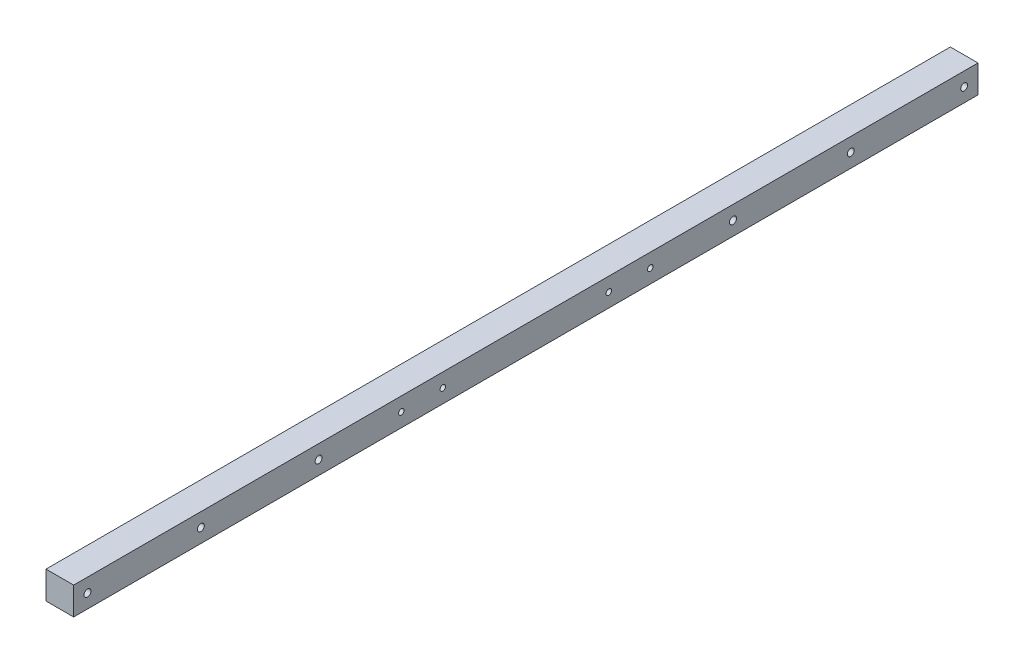
ISO-10303-21;
HEADER;
FILE_DESCRIPTION(('STEP AP214'),'2;1');
FILE_NAME('part.step','',(''),(''),'','','');
FILE_SCHEMA(('AUTOMOTIVE_DESIGN { 1 0 10303 214 1 1 1 1 }'));
ENDSEC;
DATA;
#1=APPLICATION_CONTEXT('core data for automotive mechanical design processes');
#2=APPLICATION_PROTOCOL_DEFINITION('international standard','automotive_design',2000,#1);
#3=PRODUCT_CONTEXT('',#1,'mechanical');
#4=PRODUCT('Part','Part','',(#3));
#5=PRODUCT_RELATED_PRODUCT_CATEGORY('part','',(#4));
#6=PRODUCT_DEFINITION_FORMATION('','',#4);
#7=PRODUCT_DEFINITION_CONTEXT('part definition',#1,'design');
#8=PRODUCT_DEFINITION('design','',#6,#7);
#9=PRODUCT_DEFINITION_SHAPE('','',#8);
#10=(LENGTH_UNIT() NAMED_UNIT(*) SI_UNIT(.MILLI.,.METRE.));
#11=(NAMED_UNIT(*) PLANE_ANGLE_UNIT() SI_UNIT($,.RADIAN.));
#12=(NAMED_UNIT(*) SI_UNIT($,.STERADIAN.) SOLID_ANGLE_UNIT());
#13=UNCERTAINTY_MEASURE_WITH_UNIT(LENGTH_MEASURE(1.E-05),#10,'distance_accuracy_value','');
#14=(GEOMETRIC_REPRESENTATION_CONTEXT(3) GLOBAL_UNCERTAINTY_ASSIGNED_CONTEXT((#13)) GLOBAL_UNIT_ASSIGNED_CONTEXT((#10,
#11,#12)) REPRESENTATION_CONTEXT('',''));
#15=CARTESIAN_POINT('',(0.,0.,0.));
#16=DIRECTION('',(0.,0.,1.));
#17=DIRECTION('',(1.,0.,0.));
#18=AXIS2_PLACEMENT_3D('',#15,#16,#17);
#19=CARTESIAN_POINT('',(12.7,-12.7,830.58));
#20=DIRECTION('',(-1.,0.,0.));
#21=DIRECTION('',(0.,0.,1.));
#22=AXIS2_PLACEMENT_3D('',#19,#20,#21);
#23=PLANE('',#22);
#24=CARTESIAN_POINT('',(12.7,0.,605.58));
#25=DIRECTION('',(-1.,0.,0.));
#26=DIRECTION('',(0.,0.,1.));
#27=AXIS2_PLACEMENT_3D('',#24,#25,#26);
#28=CIRCLE('',#27,3.24999999999995);
#29=CARTESIAN_POINT('',(12.7,0.,608.83));
#30=VERTEX_POINT('',#29);
#31=EDGE_CURVE('E126',#30,#30,#28,.T.);
#32=ORIENTED_EDGE('',*,*,#31,.T.);
#33=EDGE_LOOP('',(#32));
#34=FACE_BOUND('',#33,.T.);
#35=CARTESIAN_POINT('',(12.7,0.,225.));
#36=DIRECTION('',(-1.,0.,0.));
#37=DIRECTION('',(0.,0.,1.));
#38=AXIS2_PLACEMENT_3D('',#35,#36,#37);
#39=CIRCLE('',#38,3.25000000000001);
#40=CARTESIAN_POINT('',(12.7,0.,228.25));
#41=VERTEX_POINT('',#40);
#42=EDGE_CURVE('E242',#41,#41,#39,.T.);
#43=ORIENTED_EDGE('',*,*,#42,.T.);
#44=EDGE_LOOP('',(#43));
#45=FACE_BOUND('',#44,.T.);
#46=CARTESIAN_POINT('',(12.7,0.,300.99));
#47=DIRECTION('',(1.,0.,0.));
#48=DIRECTION('',(0.,0.,-1.));
#49=AXIS2_PLACEMENT_3D('',#46,#47,#48);
#50=CIRCLE('',#49,2.55269999999999);
#51=CARTESIAN_POINT('',(12.7,0.,298.4373));
#52=VERTEX_POINT('',#51);
#53=EDGE_CURVE('E118',#52,#52,#50,.T.);
#54=ORIENTED_EDGE('',*,*,#53,.F.);
#55=EDGE_LOOP('',(#54));
#56=FACE_BOUND('',#55,.T.);
#57=CARTESIAN_POINT('',(12.7,0.,529.59));
#58=DIRECTION('',(1.,0.,0.));
#59=DIRECTION('',(0.,0.,-1.));
#60=AXIS2_PLACEMENT_3D('',#57,#58,#59);
#61=CIRCLE('',#60,2.55269999999999);
#62=CARTESIAN_POINT('',(12.7,0.,527.0373));
#63=VERTEX_POINT('',#62);
#64=EDGE_CURVE('E117',#63,#63,#61,.T.);
#65=ORIENTED_EDGE('',*,*,#64,.F.);
#66=EDGE_LOOP('',(#65));
#67=FACE_BOUND('',#66,.T.);
#68=CARTESIAN_POINT('',(12.7,0.,491.49));
#69=DIRECTION('',(1.,0.,0.));
#70=DIRECTION('',(0.,0.,-1.));
#71=AXIS2_PLACEMENT_3D('',#68,#69,#70);
#72=CIRCLE('',#71,2.55269999999999);
#73=CARTESIAN_POINT('',(12.7,0.,488.9373));
#74=VERTEX_POINT('',#73);
#75=EDGE_CURVE('E133',#74,#74,#72,.T.);
#76=ORIENTED_EDGE('',*,*,#75,.F.);
#77=EDGE_LOOP('',(#76));
#78=FACE_BOUND('',#77,.T.);
#79=CARTESIAN_POINT('',(12.7,0.,339.09));
#80=DIRECTION('',(1.,0.,0.));
#81=DIRECTION('',(0.,0.,-1.));
#82=AXIS2_PLACEMENT_3D('',#79,#80,#81);
#83=CIRCLE('',#82,2.55269999999999);
#84=CARTESIAN_POINT('',(12.7,0.,336.5373));
#85=VERTEX_POINT('',#84);
#86=EDGE_CURVE('E141',#85,#85,#83,.T.);
#87=ORIENTED_EDGE('',*,*,#86,.F.);
#88=EDGE_LOOP('',(#87));
#89=FACE_BOUND('',#88,.T.);
#90=CARTESIAN_POINT('',(12.7,0.,817.88));
#91=DIRECTION('',(-1.,0.,0.));
#92=DIRECTION('',(0.,0.,1.));
#93=AXIS2_PLACEMENT_3D('',#90,#91,#92);
#94=CIRCLE('',#93,3.175);
#95=CARTESIAN_POINT('',(12.7,0.,821.055));
#96=VERTEX_POINT('',#95);
#97=EDGE_CURVE('E150',#96,#96,#94,.T.);
#98=ORIENTED_EDGE('',*,*,#97,.T.);
#99=EDGE_LOOP('',(#98));
#100=FACE_BOUND('',#99,.T.);
#101=CARTESIAN_POINT('',(12.7,0.,713.74));
#102=DIRECTION('',(-1.,0.,0.));
#103=DIRECTION('',(0.,0.,1.));
#104=AXIS2_PLACEMENT_3D('',#101,#102,#103);
#105=CIRCLE('',#104,3.175);
#106=CARTESIAN_POINT('',(12.7,0.,716.915));
#107=VERTEX_POINT('',#106);
#108=EDGE_CURVE('E159',#107,#107,#105,.T.);
#109=ORIENTED_EDGE('',*,*,#108,.T.);
#110=EDGE_LOOP('',(#109));
#111=FACE_BOUND('',#110,.T.);
#112=CARTESIAN_POINT('',(12.7,0.,12.7));
#113=DIRECTION('',(1.,0.,0.));
#114=DIRECTION('',(0.,0.,-1.));
#115=AXIS2_PLACEMENT_3D('',#112,#113,#114);
#116=CIRCLE('',#115,3.175);
#117=CARTESIAN_POINT('',(12.7,0.,9.525));
#118=VERTEX_POINT('',#117);
#119=EDGE_CURVE('E166',#118,#118,#116,.T.);
#120=ORIENTED_EDGE('',*,*,#119,.F.);
#121=EDGE_LOOP('',(#120));
#122=FACE_BOUND('',#121,.T.);
#123=CARTESIAN_POINT('',(12.7,0.,116.84));
#124=DIRECTION('',(1.,0.,0.));
#125=DIRECTION('',(0.,0.,-1.));
#126=AXIS2_PLACEMENT_3D('',#123,#124,#125);
#127=CIRCLE('',#126,3.175);
#128=CARTESIAN_POINT('',(12.7,0.,113.665));
#129=VERTEX_POINT('',#128);
#130=EDGE_CURVE('E175',#129,#129,#127,.T.);
#131=ORIENTED_EDGE('',*,*,#130,.F.);
#132=EDGE_LOOP('',(#131));
#133=FACE_BOUND('',#132,.T.);
#134=DIRECTION('',(0.,1.,0.));
#135=VECTOR('',#134,1.);
#136=CARTESIAN_POINT('',(12.7,-12.7,0.));
#137=LINE('',#136,#135);
#138=CARTESIAN_POINT('',(12.7,-12.7,0.));
#139=VERTEX_POINT('',#138);
#140=CARTESIAN_POINT('',(12.7,12.7,0.));
#141=VERTEX_POINT('',#140);
#142=EDGE_CURVE('E170',#139,#141,#137,.T.);
#143=ORIENTED_EDGE('',*,*,#142,.T.);
#144=DIRECTION('',(0.,0.,-1.));
#145=VECTOR('',#144,1.);
#146=CARTESIAN_POINT('',(12.7,12.7,830.58));
#147=LINE('',#146,#145);
#148=CARTESIAN_POINT('',(12.7,12.7,830.58));
#149=VERTEX_POINT('',#148);
#150=EDGE_CURVE('E11',#149,#141,#147,.T.);
#151=ORIENTED_EDGE('',*,*,#150,.F.);
#152=DIRECTION('',(0.,1.,0.));
#153=VECTOR('',#152,1.);
#154=CARTESIAN_POINT('',(12.7,-12.7,830.58));
#155=LINE('',#154,#153);
#156=CARTESIAN_POINT('',(12.7,-12.7,830.58));
#157=VERTEX_POINT('',#156);
#158=EDGE_CURVE('E182',#157,#149,#155,.T.);
#159=ORIENTED_EDGE('',*,*,#158,.F.);
#160=DIRECTION('',(0.,0.,-1.));
#161=VECTOR('',#160,1.);
#162=CARTESIAN_POINT('',(12.7,-12.7,830.58));
#163=LINE('',#162,#161);
#164=EDGE_CURVE('E192',#157,#139,#163,.T.);
#165=ORIENTED_EDGE('',*,*,#164,.T.);
#166=EDGE_LOOP('',(#143,#151,#159,#165));
#167=FACE_BOUND('',#166,.T.);
#168=ADVANCED_FACE('F45',(#34,#45,#56,#67,#78,#89,#100,#111,#122,#133,#167),#23,.F.);
#169=CARTESIAN_POINT('',(-12.7,12.7,830.58));
#170=DIRECTION('',(0.,-1.,0.));
#171=DIRECTION('',(0.,0.,-1.));
#172=AXIS2_PLACEMENT_3D('',#169,#170,#171);
#173=PLANE('',#172);
#174=DIRECTION('',(-1.,0.,0.));
#175=VECTOR('',#174,1.);
#176=CARTESIAN_POINT('',(-12.7,12.7,0.));
#177=LINE('',#176,#175);
#178=CARTESIAN_POINT('',(-12.7,12.7,0.));
#179=VERTEX_POINT('',#178);
#180=EDGE_CURVE('E196',#141,#179,#177,.T.);
#181=ORIENTED_EDGE('',*,*,#180,.T.);
#182=DIRECTION('',(0.,0.,-1.));
#183=VECTOR('',#182,1.);
#184=CARTESIAN_POINT('',(-12.7,12.7,830.58));
#185=LINE('',#184,#183);
#186=CARTESIAN_POINT('',(-12.7,12.7,830.58));
#187=VERTEX_POINT('',#186);
#188=EDGE_CURVE('E54',#187,#179,#185,.T.);
#189=ORIENTED_EDGE('',*,*,#188,.F.);
#190=DIRECTION('',(-1.,0.,0.));
#191=VECTOR('',#190,1.);
#192=CARTESIAN_POINT('',(-12.7,12.7,830.58));
#193=LINE('',#192,#191);
#194=EDGE_CURVE('E93',#149,#187,#193,.T.);
#195=ORIENTED_EDGE('',*,*,#194,.F.);
#196=ORIENTED_EDGE('',*,*,#150,.T.);
#197=EDGE_LOOP('',(#181,#189,#195,#196));
#198=FACE_BOUND('',#197,.T.);
#199=ADVANCED_FACE('F226',(#198),#173,.F.);
#200=CARTESIAN_POINT('',(-12.7,-12.7,830.58));
#201=DIRECTION('',(1.,0.,0.));
#202=DIRECTION('',(0.,0.,-1.));
#203=AXIS2_PLACEMENT_3D('',#200,#201,#202);
#204=PLANE('',#203);
#205=CARTESIAN_POINT('',(-12.7,0.,605.58));
#206=DIRECTION('',(-1.,0.,0.));
#207=DIRECTION('',(0.,0.,1.));
#208=AXIS2_PLACEMENT_3D('',#205,#206,#207);
#209=CIRCLE('',#208,3.24999999999995);
#210=CARTESIAN_POINT('',(-12.7,0.,608.83));
#211=VERTEX_POINT('',#210);
#212=EDGE_CURVE('E318',#211,#211,#209,.T.);
#213=ORIENTED_EDGE('',*,*,#212,.F.);
#214=EDGE_LOOP('',(#213));
#215=FACE_BOUND('',#214,.T.);
#216=CARTESIAN_POINT('',(-12.7,0.,225.));
#217=DIRECTION('',(-1.,0.,0.));
#218=DIRECTION('',(0.,0.,1.));
#219=AXIS2_PLACEMENT_3D('',#216,#217,#218);
#220=CIRCLE('',#219,3.25000000000001);
#221=CARTESIAN_POINT('',(-12.7,0.,228.25));
#222=VERTEX_POINT('',#221);
#223=EDGE_CURVE('E324',#222,#222,#220,.T.);
#224=ORIENTED_EDGE('',*,*,#223,.F.);
#225=EDGE_LOOP('',(#224));
#226=FACE_BOUND('',#225,.T.);
#227=CARTESIAN_POINT('',(-12.7,0.,817.88));
#228=DIRECTION('',(-1.,0.,0.));
#229=DIRECTION('',(0.,0.,1.));
#230=AXIS2_PLACEMENT_3D('',#227,#228,#229);
#231=CIRCLE('',#230,3.175);
#232=CARTESIAN_POINT('',(-12.7,0.,821.055));
#233=VERTEX_POINT('',#232);
#234=EDGE_CURVE('E155',#233,#233,#231,.T.);
#235=ORIENTED_EDGE('',*,*,#234,.F.);
#236=EDGE_LOOP('',(#235));
#237=FACE_BOUND('',#236,.T.);
#238=CARTESIAN_POINT('',(-12.7,0.,713.74));
#239=DIRECTION('',(-1.,0.,0.));
#240=DIRECTION('',(0.,0.,1.));
#241=AXIS2_PLACEMENT_3D('',#238,#239,#240);
#242=CIRCLE('',#241,3.175);
#243=CARTESIAN_POINT('',(-12.7,0.,716.915));
#244=VERTEX_POINT('',#243);
#245=EDGE_CURVE('E149',#244,#244,#242,.T.);
#246=ORIENTED_EDGE('',*,*,#245,.F.);
#247=EDGE_LOOP('',(#246));
#248=FACE_BOUND('',#247,.T.);
#249=CARTESIAN_POINT('',(-12.7,0.,12.7));
#250=DIRECTION('',(1.,0.,0.));
#251=DIRECTION('',(0.,0.,-1.));
#252=AXIS2_PLACEMENT_3D('',#249,#250,#251);
#253=CIRCLE('',#252,3.175);
#254=CARTESIAN_POINT('',(-12.7,0.,9.525));
#255=VERTEX_POINT('',#254);
#256=EDGE_CURVE('E171',#255,#255,#253,.T.);
#257=ORIENTED_EDGE('',*,*,#256,.T.);
#258=EDGE_LOOP('',(#257));
#259=FACE_BOUND('',#258,.T.);
#260=CARTESIAN_POINT('',(-12.7,0.,116.84));
#261=DIRECTION('',(1.,0.,0.));
#262=DIRECTION('',(0.,0.,-1.));
#263=AXIS2_PLACEMENT_3D('',#260,#261,#262);
#264=CIRCLE('',#263,3.175);
#265=CARTESIAN_POINT('',(-12.7,0.,113.665));
#266=VERTEX_POINT('',#265);
#267=EDGE_CURVE('E154',#266,#266,#264,.T.);
#268=ORIENTED_EDGE('',*,*,#267,.T.);
#269=EDGE_LOOP('',(#268));
#270=FACE_BOUND('',#269,.T.);
#271=DIRECTION('',(0.,-1.,0.));
#272=VECTOR('',#271,1.);
#273=CARTESIAN_POINT('',(-12.7,-12.7,0.));
#274=LINE('',#273,#272);
#275=CARTESIAN_POINT('',(-12.7,-12.7,0.));
#276=VERTEX_POINT('',#275);
#277=EDGE_CURVE('E80',#179,#276,#274,.T.);
#278=ORIENTED_EDGE('',*,*,#277,.T.);
#279=DIRECTION('',(0.,0.,-1.));
#280=VECTOR('',#279,1.);
#281=CARTESIAN_POINT('',(-12.7,-12.7,830.58));
#282=LINE('',#281,#280);
#283=CARTESIAN_POINT('',(-12.7,-12.7,830.58));
#284=VERTEX_POINT('',#283);
#285=EDGE_CURVE('E205',#284,#276,#282,.T.);
#286=ORIENTED_EDGE('',*,*,#285,.F.);
#287=DIRECTION('',(0.,-1.,0.));
#288=VECTOR('',#287,1.);
#289=CARTESIAN_POINT('',(-12.7,-12.7,830.58));
#290=LINE('',#289,#288);
#291=EDGE_CURVE('E187',#187,#284,#290,.T.);
#292=ORIENTED_EDGE('',*,*,#291,.F.);
#293=ORIENTED_EDGE('',*,*,#188,.T.);
#294=EDGE_LOOP('',(#278,#286,#292,#293));
#295=FACE_BOUND('',#294,.T.);
#296=ADVANCED_FACE('F209',(#215,#226,#237,#248,#259,#270,#295),#204,.F.);
#297=CARTESIAN_POINT('',(-12.7,-12.7,830.58));
#298=DIRECTION('',(0.,1.,0.));
#299=DIRECTION('',(0.,0.,1.));
#300=AXIS2_PLACEMENT_3D('',#297,#298,#299);
#301=PLANE('',#300);
#302=DIRECTION('',(1.,0.,0.));
#303=VECTOR('',#302,1.);
#304=CARTESIAN_POINT('',(-12.7,-12.7,0.));
#305=LINE('',#304,#303);
#306=EDGE_CURVE('E86',#276,#139,#305,.T.);
#307=ORIENTED_EDGE('',*,*,#306,.T.);
#308=ORIENTED_EDGE('',*,*,#164,.F.);
#309=DIRECTION('',(1.,0.,0.));
#310=VECTOR('',#309,1.);
#311=CARTESIAN_POINT('',(-12.7,-12.7,830.58));
#312=LINE('',#311,#310);
#313=EDGE_CURVE('E62',#284,#157,#312,.T.);
#314=ORIENTED_EDGE('',*,*,#313,.F.);
#315=ORIENTED_EDGE('',*,*,#285,.T.);
#316=EDGE_LOOP('',(#307,#308,#314,#315));
#317=FACE_BOUND('',#316,.T.);
#318=ADVANCED_FACE('F216',(#317),#301,.F.);
#319=CARTESIAN_POINT('',(0.,0.,830.58));
#320=DIRECTION('',(0.,0.,-1.));
#321=DIRECTION('',(-1.,0.,0.));
#322=AXIS2_PLACEMENT_3D('',#319,#320,#321);
#323=PLANE('',#322);
#324=ORIENTED_EDGE('',*,*,#158,.T.);
#325=ORIENTED_EDGE('',*,*,#194,.T.);
#326=ORIENTED_EDGE('',*,*,#291,.T.);
#327=ORIENTED_EDGE('',*,*,#313,.T.);
#328=EDGE_LOOP('',(#324,#325,#326,#327));
#329=FACE_BOUND('',#328,.T.);
#330=ADVANCED_FACE('F218',(#329),#323,.F.);
#331=CARTESIAN_POINT('',(0.,0.,0.));
#332=DIRECTION('',(0.,0.,-1.));
#333=DIRECTION('',(-1.,0.,0.));
#334=AXIS2_PLACEMENT_3D('',#331,#332,#333);
#335=PLANE('',#334);
#336=ORIENTED_EDGE('',*,*,#142,.F.);
#337=ORIENTED_EDGE('',*,*,#306,.F.);
#338=ORIENTED_EDGE('',*,*,#277,.F.);
#339=ORIENTED_EDGE('',*,*,#180,.F.);
#340=EDGE_LOOP('',(#336,#337,#338,#339));
#341=FACE_BOUND('',#340,.T.);
#342=ADVANCED_FACE('F212',(#341),#335,.T.);
#343=CARTESIAN_POINT('',(12.7,0.,116.84));
#344=DIRECTION('',(-1.,0.,0.));
#345=DIRECTION('',(0.,0.,1.));
#346=AXIS2_PLACEMENT_3D('',#343,#344,#345);
#347=CYLINDRICAL_SURFACE('',#346,3.175);
#348=ORIENTED_EDGE('',*,*,#130,.T.);
#349=EDGE_LOOP('',(#348));
#350=FACE_BOUND('',#349,.T.);
#351=ORIENTED_EDGE('',*,*,#267,.F.);
#352=EDGE_LOOP('',(#351));
#353=FACE_BOUND('',#352,.T.);
#354=ADVANCED_FACE('F259',(#350,#353),#347,.F.);
#355=CARTESIAN_POINT('',(12.7,0.,12.7));
#356=DIRECTION('',(-1.,0.,0.));
#357=DIRECTION('',(0.,0.,1.));
#358=AXIS2_PLACEMENT_3D('',#355,#356,#357);
#359=CYLINDRICAL_SURFACE('',#358,3.175);
#360=ORIENTED_EDGE('',*,*,#119,.T.);
#361=EDGE_LOOP('',(#360));
#362=FACE_BOUND('',#361,.T.);
#363=ORIENTED_EDGE('',*,*,#256,.F.);
#364=EDGE_LOOP('',(#363));
#365=FACE_BOUND('',#364,.T.);
#366=ADVANCED_FACE('F262',(#362,#365),#359,.F.);
#367=CARTESIAN_POINT('',(12.7,0.,713.74));
#368=DIRECTION('',(-1.,0.,0.));
#369=DIRECTION('',(0.,0.,1.));
#370=AXIS2_PLACEMENT_3D('',#367,#368,#369);
#371=CYLINDRICAL_SURFACE('',#370,3.175);
#372=ORIENTED_EDGE('',*,*,#108,.F.);
#373=EDGE_LOOP('',(#372));
#374=FACE_BOUND('',#373,.T.);
#375=ORIENTED_EDGE('',*,*,#245,.T.);
#376=EDGE_LOOP('',(#375));
#377=FACE_BOUND('',#376,.T.);
#378=ADVANCED_FACE('F270',(#374,#377),#371,.F.);
#379=CARTESIAN_POINT('',(12.7,0.,817.88));
#380=DIRECTION('',(-1.,0.,0.));
#381=DIRECTION('',(0.,0.,1.));
#382=AXIS2_PLACEMENT_3D('',#379,#380,#381);
#383=CYLINDRICAL_SURFACE('',#382,3.175);
#384=ORIENTED_EDGE('',*,*,#97,.F.);
#385=EDGE_LOOP('',(#384));
#386=FACE_BOUND('',#385,.T.);
#387=ORIENTED_EDGE('',*,*,#234,.T.);
#388=EDGE_LOOP('',(#387));
#389=FACE_BOUND('',#388,.T.);
#390=ADVANCED_FACE('F276',(#386,#389),#383,.F.);
#391=CARTESIAN_POINT('',(-6.35,0.,339.09));
#392=DIRECTION('',(1.,0.,0.));
#393=DIRECTION('',(0.,0.,-1.));
#394=AXIS2_PLACEMENT_3D('',#391,#392,#393);
#395=CONICAL_SURFACE('',#394,2.5527,1.02974425867665);
#396=CARTESIAN_POINT('',(-7.88381690219166,0.,339.09));
#397=VERTEX_POINT('',#396);
#398=VERTEX_LOOP('',#397);
#399=FACE_BOUND('',#398,.T.);
#400=CARTESIAN_POINT('',(-6.35,0.,339.09));
#401=DIRECTION('',(1.,0.,0.));
#402=DIRECTION('',(0.,0.,-1.));
#403=AXIS2_PLACEMENT_3D('',#400,#401,#402);
#404=CIRCLE('',#403,2.5527);
#405=CARTESIAN_POINT('',(-6.35,0.,336.5373));
#406=VERTEX_POINT('',#405);
#407=EDGE_CURVE('E145',#406,#406,#404,.T.);
#408=ORIENTED_EDGE('',*,*,#407,.T.);
#409=EDGE_LOOP('',(#408));
#410=FACE_BOUND('',#409,.T.);
#411=ADVANCED_FACE('F280',(#399,#410),#395,.F.);
#412=CARTESIAN_POINT('',(12.7,0.,339.09));
#413=DIRECTION('',(1.,0.,0.));
#414=DIRECTION('',(0.,0.,-1.));
#415=AXIS2_PLACEMENT_3D('',#412,#413,#414);
#416=CYLINDRICAL_SURFACE('',#415,2.55269999999999);
#417=ORIENTED_EDGE('',*,*,#407,.F.);
#418=EDGE_LOOP('',(#417));
#419=FACE_BOUND('',#418,.T.);
#420=ORIENTED_EDGE('',*,*,#86,.T.);
#421=EDGE_LOOP('',(#420));
#422=FACE_BOUND('',#421,.T.);
#423=ADVANCED_FACE('F284',(#419,#422),#416,.F.);
#424=CARTESIAN_POINT('',(-6.35,0.,491.49));
#425=DIRECTION('',(1.,0.,0.));
#426=DIRECTION('',(0.,0.,-1.));
#427=AXIS2_PLACEMENT_3D('',#424,#425,#426);
#428=CONICAL_SURFACE('',#427,2.5527,1.02974425867665);
#429=CARTESIAN_POINT('',(-7.88381690219166,0.,491.49));
#430=VERTEX_POINT('',#429);
#431=VERTEX_LOOP('',#430);
#432=FACE_BOUND('',#431,.T.);
#433=CARTESIAN_POINT('',(-6.35,0.,491.49));
#434=DIRECTION('',(1.,0.,0.));
#435=DIRECTION('',(0.,0.,-1.));
#436=AXIS2_PLACEMENT_3D('',#433,#434,#435);
#437=CIRCLE('',#436,2.5527);
#438=CARTESIAN_POINT('',(-6.35,0.,488.9373));
#439=VERTEX_POINT('',#438);
#440=EDGE_CURVE('E137',#439,#439,#437,.T.);
#441=ORIENTED_EDGE('',*,*,#440,.T.);
#442=EDGE_LOOP('',(#441));
#443=FACE_BOUND('',#442,.T.);
#444=ADVANCED_FACE('F288',(#432,#443),#428,.F.);
#445=CARTESIAN_POINT('',(12.7,0.,491.49));
#446=DIRECTION('',(1.,0.,0.));
#447=DIRECTION('',(0.,0.,-1.));
#448=AXIS2_PLACEMENT_3D('',#445,#446,#447);
#449=CYLINDRICAL_SURFACE('',#448,2.55269999999999);
#450=ORIENTED_EDGE('',*,*,#440,.F.);
#451=EDGE_LOOP('',(#450));
#452=FACE_BOUND('',#451,.T.);
#453=ORIENTED_EDGE('',*,*,#75,.T.);
#454=EDGE_LOOP('',(#453));
#455=FACE_BOUND('',#454,.T.);
#456=ADVANCED_FACE('F292',(#452,#455),#449,.F.);
#457=CARTESIAN_POINT('',(-6.35,0.,529.59));
#458=DIRECTION('',(1.,0.,0.));
#459=DIRECTION('',(0.,0.,-1.));
#460=AXIS2_PLACEMENT_3D('',#457,#458,#459);
#461=CONICAL_SURFACE('',#460,2.5527,1.02974425867665);
#462=CARTESIAN_POINT('',(-7.88381690219166,0.,529.59));
#463=VERTEX_POINT('',#462);
#464=VERTEX_LOOP('',#463);
#465=FACE_BOUND('',#464,.T.);
#466=CARTESIAN_POINT('',(-6.35,0.,529.59));
#467=DIRECTION('',(1.,0.,0.));
#468=DIRECTION('',(0.,0.,-1.));
#469=AXIS2_PLACEMENT_3D('',#466,#467,#468);
#470=CIRCLE('',#469,2.5527);
#471=CARTESIAN_POINT('',(-6.35,0.,527.0373));
#472=VERTEX_POINT('',#471);
#473=EDGE_CURVE('E123',#472,#472,#470,.T.);
#474=ORIENTED_EDGE('',*,*,#473,.T.);
#475=EDGE_LOOP('',(#474));
#476=FACE_BOUND('',#475,.T.);
#477=ADVANCED_FACE('F296',(#465,#476),#461,.F.);
#478=CARTESIAN_POINT('',(12.7,0.,529.59));
#479=DIRECTION('',(1.,0.,0.));
#480=DIRECTION('',(0.,0.,-1.));
#481=AXIS2_PLACEMENT_3D('',#478,#479,#480);
#482=CYLINDRICAL_SURFACE('',#481,2.55269999999999);
#483=ORIENTED_EDGE('',*,*,#473,.F.);
#484=EDGE_LOOP('',(#483));
#485=FACE_BOUND('',#484,.T.);
#486=ORIENTED_EDGE('',*,*,#64,.T.);
#487=EDGE_LOOP('',(#486));
#488=FACE_BOUND('',#487,.T.);
#489=ADVANCED_FACE('F110',(#485,#488),#482,.F.);
#490=CARTESIAN_POINT('',(-6.35,0.,300.99));
#491=DIRECTION('',(1.,0.,0.));
#492=DIRECTION('',(0.,0.,-1.));
#493=AXIS2_PLACEMENT_3D('',#490,#491,#492);
#494=CONICAL_SURFACE('',#493,2.5527,1.02974425867665);
#495=CARTESIAN_POINT('',(-7.88381690219166,0.,300.99));
#496=VERTEX_POINT('',#495);
#497=VERTEX_LOOP('',#496);
#498=FACE_BOUND('',#497,.T.);
#499=CARTESIAN_POINT('',(-6.35,0.,300.99));
#500=DIRECTION('',(1.,0.,0.));
#501=DIRECTION('',(0.,0.,-1.));
#502=AXIS2_PLACEMENT_3D('',#499,#500,#501);
#503=CIRCLE('',#502,2.5527);
#504=CARTESIAN_POINT('',(-6.35,0.,298.4373));
#505=VERTEX_POINT('',#504);
#506=EDGE_CURVE('E114',#505,#505,#503,.T.);
#507=ORIENTED_EDGE('',*,*,#506,.T.);
#508=EDGE_LOOP('',(#507));
#509=FACE_BOUND('',#508,.T.);
#510=ADVANCED_FACE('F106',(#498,#509),#494,.F.);
#511=CARTESIAN_POINT('',(12.7,0.,300.99));
#512=DIRECTION('',(1.,0.,0.));
#513=DIRECTION('',(0.,0.,-1.));
#514=AXIS2_PLACEMENT_3D('',#511,#512,#513);
#515=CYLINDRICAL_SURFACE('',#514,2.55269999999999);
#516=ORIENTED_EDGE('',*,*,#506,.F.);
#517=EDGE_LOOP('',(#516));
#518=FACE_BOUND('',#517,.T.);
#519=ORIENTED_EDGE('',*,*,#53,.T.);
#520=EDGE_LOOP('',(#519));
#521=FACE_BOUND('',#520,.T.);
#522=ADVANCED_FACE('F109',(#518,#521),#515,.F.);
#523=CARTESIAN_POINT('',(12.7,0.,225.));
#524=DIRECTION('',(-1.,0.,0.));
#525=DIRECTION('',(0.,0.,1.));
#526=AXIS2_PLACEMENT_3D('',#523,#524,#525);
#527=CYLINDRICAL_SURFACE('',#526,3.25000000000001);
#528=ORIENTED_EDGE('',*,*,#42,.F.);
#529=EDGE_LOOP('',(#528));
#530=FACE_BOUND('',#529,.T.);
#531=ORIENTED_EDGE('',*,*,#223,.T.);
#532=EDGE_LOOP('',(#531));
#533=FACE_BOUND('',#532,.T.);
#534=ADVANCED_FACE('F306',(#530,#533),#527,.F.);
#535=CARTESIAN_POINT('',(12.7,0.,605.58));
#536=DIRECTION('',(-1.,0.,0.));
#537=DIRECTION('',(0.,0.,1.));
#538=AXIS2_PLACEMENT_3D('',#535,#536,#537);
#539=CYLINDRICAL_SURFACE('',#538,3.24999999999995);
#540=ORIENTED_EDGE('',*,*,#31,.F.);
#541=EDGE_LOOP('',(#540));
#542=FACE_BOUND('',#541,.T.);
#543=ORIENTED_EDGE('',*,*,#212,.T.);
#544=EDGE_LOOP('',(#543));
#545=FACE_BOUND('',#544,.T.);
#546=ADVANCED_FACE('F309',(#542,#545),#539,.F.);
#547=CLOSED_SHELL('',(#168,#199,#296,#318,#330,#342,#354,#366,#378,#390,#411,#423,#444,#456,
#477,#489,#510,#522,#534,#546));
#548=MANIFOLD_SOLID_BREP('B2',#547);
#549=ADVANCED_BREP_SHAPE_REPRESENTATION('',(#18,#548),#14);
#550=SHAPE_DEFINITION_REPRESENTATION(#9,#549);
ENDSEC;
END-ISO-10303-21;
